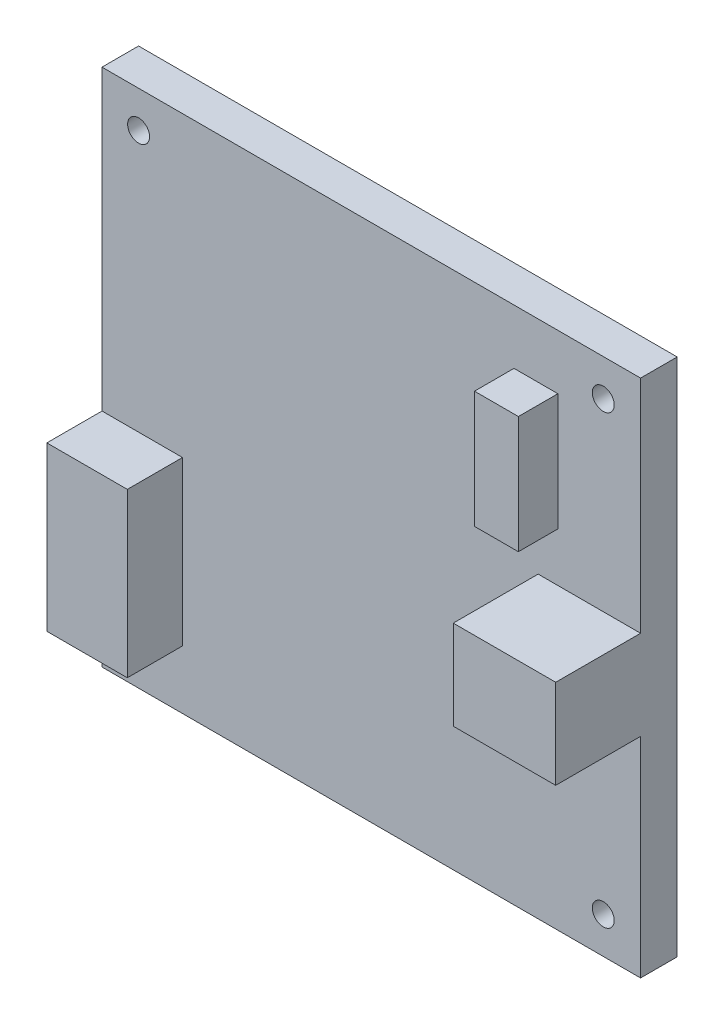
ISO-10303-21;
HEADER;
FILE_DESCRIPTION(('STEP AP214'),'2;1');
FILE_NAME('part.step','',(''),(''),'','','');
FILE_SCHEMA(('AUTOMOTIVE_DESIGN { 1 0 10303 214 1 1 1 1 }'));
ENDSEC;
DATA;
#1=APPLICATION_CONTEXT('core data for automotive mechanical design processes');
#2=APPLICATION_PROTOCOL_DEFINITION('international standard','automotive_design',2000,#1);
#3=PRODUCT_CONTEXT('',#1,'mechanical');
#4=PRODUCT('Part','Part','',(#3));
#5=PRODUCT_RELATED_PRODUCT_CATEGORY('part','',(#4));
#6=PRODUCT_DEFINITION_FORMATION('','',#4);
#7=PRODUCT_DEFINITION_CONTEXT('part definition',#1,'design');
#8=PRODUCT_DEFINITION('design','',#6,#7);
#9=PRODUCT_DEFINITION_SHAPE('','',#8);
#10=(LENGTH_UNIT() NAMED_UNIT(*) SI_UNIT(.MILLI.,.METRE.));
#11=(NAMED_UNIT(*) PLANE_ANGLE_UNIT() SI_UNIT($,.RADIAN.));
#12=(NAMED_UNIT(*) SI_UNIT($,.STERADIAN.) SOLID_ANGLE_UNIT());
#13=UNCERTAINTY_MEASURE_WITH_UNIT(LENGTH_MEASURE(1.E-05),#10,'distance_accuracy_value','');
#14=(GEOMETRIC_REPRESENTATION_CONTEXT(3) GLOBAL_UNCERTAINTY_ASSIGNED_CONTEXT((#13)) GLOBAL_UNIT_ASSIGNED_CONTEXT((#10,
#11,#12)) REPRESENTATION_CONTEXT('',''));
#15=CARTESIAN_POINT('',(0.,0.,0.));
#16=DIRECTION('',(0.,0.,1.));
#17=DIRECTION('',(1.,0.,0.));
#18=AXIS2_PLACEMENT_3D('',#15,#16,#17);
#19=CARTESIAN_POINT('',(0.,0.,5.));
#20=DIRECTION('',(0.,0.,-1.));
#21=DIRECTION('',(-1.,0.,0.));
#22=AXIS2_PLACEMENT_3D('',#19,#20,#21);
#23=PLANE('',#22);
#24=DIRECTION('',(-1.,0.,0.));
#25=VECTOR('',#24,1.);
#26=CARTESIAN_POINT('',(73.6,40.8,5.));
#27=LINE('',#26,#25);
#28=CARTESIAN_POINT('',(73.6,40.8,5.));
#29=VERTEX_POINT('',#28);
#30=CARTESIAN_POINT('',(59.6,40.8,5.));
#31=VERTEX_POINT('',#30);
#32=EDGE_CURVE('E168',#29,#31,#27,.T.);
#33=ORIENTED_EDGE('',*,*,#32,.F.);
#34=DIRECTION('',(0.,1.,0.));
#35=VECTOR('',#34,1.);
#36=CARTESIAN_POINT('',(73.6,0.,5.));
#37=LINE('',#36,#35);
#38=CARTESIAN_POINT('',(73.6,71.,5.));
#39=VERTEX_POINT('',#38);
#40=EDGE_CURVE('E263',#29,#39,#37,.T.);
#41=ORIENTED_EDGE('',*,*,#40,.T.);
#42=DIRECTION('',(-1.,0.,0.));
#43=VECTOR('',#42,1.);
#44=CARTESIAN_POINT('',(0.,71.,5.));
#45=LINE('',#44,#43);
#46=CARTESIAN_POINT('',(0.,71.,5.));
#47=VERTEX_POINT('',#46);
#48=EDGE_CURVE('E266',#39,#47,#45,.T.);
#49=ORIENTED_EDGE('',*,*,#48,.T.);
#50=DIRECTION('',(0.,-1.,0.));
#51=VECTOR('',#50,1.);
#52=CARTESIAN_POINT('',(0.,0.,5.));
#53=LINE('',#52,#51);
#54=CARTESIAN_POINT('',(0.,30.3,5.));
#55=VERTEX_POINT('',#54);
#56=EDGE_CURVE('E258',#47,#55,#53,.T.);
#57=ORIENTED_EDGE('',*,*,#56,.T.);
#58=DIRECTION('',(-1.,0.,0.));
#59=VECTOR('',#58,1.);
#60=CARTESIAN_POINT('',(0.,30.3,5.));
#61=LINE('',#60,#59);
#62=CARTESIAN_POINT('',(11.,30.3,5.));
#63=VERTEX_POINT('',#62);
#64=EDGE_CURVE('E208',#63,#55,#61,.T.);
#65=ORIENTED_EDGE('',*,*,#64,.F.);
#66=DIRECTION('',(0.,1.,0.));
#67=VECTOR('',#66,1.);
#68=CARTESIAN_POINT('',(11.,8.,5.));
#69=LINE('',#68,#67);
#70=CARTESIAN_POINT('',(11.,8.,5.));
#71=VERTEX_POINT('',#70);
#72=EDGE_CURVE('E217',#71,#63,#69,.T.);
#73=ORIENTED_EDGE('',*,*,#72,.F.);
#74=DIRECTION('',(1.,0.,0.));
#75=VECTOR('',#74,1.);
#76=CARTESIAN_POINT('',(0.,7.99999999999999,5.));
#77=LINE('',#76,#75);
#78=CARTESIAN_POINT('',(0.,8.,5.));
#79=VERTEX_POINT('',#78);
#80=EDGE_CURVE('E203',#79,#71,#77,.T.);
#81=ORIENTED_EDGE('',*,*,#80,.F.);
#82=CARTESIAN_POINT('',(0.,0.,5.));
#83=VERTEX_POINT('',#82);
#84=EDGE_CURVE('E261',#79,#83,#53,.T.);
#85=ORIENTED_EDGE('',*,*,#84,.T.);
#86=DIRECTION('',(1.,0.,0.));
#87=VECTOR('',#86,1.);
#88=CARTESIAN_POINT('',(0.,0.,5.));
#89=LINE('',#88,#87);
#90=CARTESIAN_POINT('',(73.6,0.,5.));
#91=VERTEX_POINT('',#90);
#92=EDGE_CURVE('E260',#83,#91,#89,.T.);
#93=ORIENTED_EDGE('',*,*,#92,.T.);
#94=CARTESIAN_POINT('',(73.6,28.6,5.));
#95=VERTEX_POINT('',#94);
#96=EDGE_CURVE('E264',#91,#95,#37,.T.);
#97=ORIENTED_EDGE('',*,*,#96,.T.);
#98=DIRECTION('',(1.,0.,0.));
#99=VECTOR('',#98,1.);
#100=CARTESIAN_POINT('',(73.6,28.6,5.));
#101=LINE('',#100,#99);
#102=CARTESIAN_POINT('',(59.6,28.6,5.));
#103=VERTEX_POINT('',#102);
#104=EDGE_CURVE('E181',#103,#95,#101,.T.);
#105=ORIENTED_EDGE('',*,*,#104,.F.);
#106=DIRECTION('',(0.,-1.,0.));
#107=VECTOR('',#106,1.);
#108=CARTESIAN_POINT('',(59.6,40.8,5.));
#109=LINE('',#108,#107);
#110=EDGE_CURVE('E171',#31,#103,#109,.T.);
#111=ORIENTED_EDGE('',*,*,#110,.F.);
#112=EDGE_LOOP('',(#33,#41,#49,#57,#65,#73,#81,#85,#93,#97,#105,#111));
#113=FACE_BOUND('',#112,.T.);
#114=CARTESIAN_POINT('',(5.,5.,5.));
#115=DIRECTION('',(0.,0.,1.));
#116=DIRECTION('',(1.,0.,0.));
#117=AXIS2_PLACEMENT_3D('',#114,#115,#116);
#118=CIRCLE('',#117,1.5);
#119=CARTESIAN_POINT('',(6.5,5.,5.));
#120=VERTEX_POINT('',#119);
#121=EDGE_CURVE('E237',#120,#120,#118,.T.);
#122=ORIENTED_EDGE('',*,*,#121,.F.);
#123=EDGE_LOOP('',(#122));
#124=FACE_BOUND('',#123,.T.);
#125=CARTESIAN_POINT('',(68.5,5.,5.));
#126=DIRECTION('',(0.,0.,1.));
#127=DIRECTION('',(1.,0.,0.));
#128=AXIS2_PLACEMENT_3D('',#125,#126,#127);
#129=CIRCLE('',#128,1.5);
#130=CARTESIAN_POINT('',(70.,5.,5.));
#131=VERTEX_POINT('',#130);
#132=EDGE_CURVE('E238',#131,#131,#129,.T.);
#133=ORIENTED_EDGE('',*,*,#132,.F.);
#134=EDGE_LOOP('',(#133));
#135=FACE_BOUND('',#134,.T.);
#136=CARTESIAN_POINT('',(68.5,66.,5.));
#137=DIRECTION('',(0.,0.,1.));
#138=DIRECTION('',(1.,0.,0.));
#139=AXIS2_PLACEMENT_3D('',#136,#137,#138);
#140=CIRCLE('',#139,1.5);
#141=CARTESIAN_POINT('',(70.,66.,5.));
#142=VERTEX_POINT('',#141);
#143=EDGE_CURVE('E244',#142,#142,#140,.T.);
#144=ORIENTED_EDGE('',*,*,#143,.F.);
#145=EDGE_LOOP('',(#144));
#146=FACE_BOUND('',#145,.T.);
#147=CARTESIAN_POINT('',(5.,66.,5.));
#148=DIRECTION('',(0.,0.,1.));
#149=DIRECTION('',(1.,0.,0.));
#150=AXIS2_PLACEMENT_3D('',#147,#148,#149);
#151=CIRCLE('',#150,1.5);
#152=CARTESIAN_POINT('',(6.5,66.,5.));
#153=VERTEX_POINT('',#152);
#154=EDGE_CURVE('E233',#153,#153,#151,.T.);
#155=ORIENTED_EDGE('',*,*,#154,.F.);
#156=EDGE_LOOP('',(#155));
#157=FACE_BOUND('',#156,.T.);
#158=DIRECTION('',(0.,-1.,0.));
#159=VECTOR('',#158,1.);
#160=CARTESIAN_POINT('',(56.3,63.5,5.));
#161=LINE('',#160,#159);
#162=CARTESIAN_POINT('',(56.3,63.5,5.));
#163=VERTEX_POINT('',#162);
#164=CARTESIAN_POINT('',(56.3,47.5,5.));
#165=VERTEX_POINT('',#164);
#166=EDGE_CURVE('E167',#163,#165,#161,.T.);
#167=ORIENTED_EDGE('',*,*,#166,.F.);
#168=DIRECTION('',(-1.,0.,0.));
#169=VECTOR('',#168,1.);
#170=CARTESIAN_POINT('',(56.3,63.5,5.));
#171=LINE('',#170,#169);
#172=CARTESIAN_POINT('',(62.3,63.5,5.));
#173=VERTEX_POINT('',#172);
#174=EDGE_CURVE('E164',#173,#163,#171,.T.);
#175=ORIENTED_EDGE('',*,*,#174,.F.);
#176=DIRECTION('',(0.,1.,0.));
#177=VECTOR('',#176,1.);
#178=CARTESIAN_POINT('',(62.3,63.5,5.));
#179=LINE('',#178,#177);
#180=CARTESIAN_POINT('',(62.3,47.5,5.));
#181=VERTEX_POINT('',#180);
#182=EDGE_CURVE('E54',#181,#173,#179,.T.);
#183=ORIENTED_EDGE('',*,*,#182,.F.);
#184=DIRECTION('',(1.,0.,0.));
#185=VECTOR('',#184,1.);
#186=CARTESIAN_POINT('',(56.3,47.5,5.));
#187=LINE('',#186,#185);
#188=EDGE_CURVE('E49',#165,#181,#187,.T.);
#189=ORIENTED_EDGE('',*,*,#188,.F.);
#190=EDGE_LOOP('',(#167,#175,#183,#189));
#191=FACE_BOUND('',#190,.T.);
#192=ADVANCED_FACE('F34',(#113,#124,#135,#146,#157,#191),#23,.F.);
#193=CARTESIAN_POINT('',(0.,0.,5.));
#194=DIRECTION('',(1.,0.,0.));
#195=DIRECTION('',(0.,0.,-1.));
#196=AXIS2_PLACEMENT_3D('',#193,#194,#195);
#197=PLANE('',#196);
#198=DIRECTION('',(0.,-1.,0.));
#199=VECTOR('',#198,1.);
#200=CARTESIAN_POINT('',(0.,0.,0.));
#201=LINE('',#200,#199);
#202=CARTESIAN_POINT('',(0.,71.,0.));
#203=VERTEX_POINT('',#202);
#204=CARTESIAN_POINT('',(0.,0.,0.));
#205=VERTEX_POINT('',#204);
#206=EDGE_CURVE('E255',#203,#205,#201,.T.);
#207=ORIENTED_EDGE('',*,*,#206,.T.);
#208=DIRECTION('',(0.,0.,-1.));
#209=VECTOR('',#208,1.);
#210=CARTESIAN_POINT('',(0.,0.,5.));
#211=LINE('',#210,#209);
#212=EDGE_CURVE('E11',#83,#205,#211,.T.);
#213=ORIENTED_EDGE('',*,*,#212,.F.);
#214=ORIENTED_EDGE('',*,*,#84,.F.);
#215=DIRECTION('',(0.,0.,-1.));
#216=VECTOR('',#215,1.);
#217=CARTESIAN_POINT('',(0.,7.99999999999999,12.54));
#218=LINE('',#217,#216);
#219=CARTESIAN_POINT('',(0.,7.99999999999999,12.54));
#220=VERTEX_POINT('',#219);
#221=EDGE_CURVE('E230',#220,#79,#218,.T.);
#222=ORIENTED_EDGE('',*,*,#221,.F.);
#223=DIRECTION('',(0.,-1.,0.));
#224=VECTOR('',#223,1.);
#225=CARTESIAN_POINT('',(0.,7.99999999999999,12.54));
#226=LINE('',#225,#224);
#227=CARTESIAN_POINT('',(0.,30.3,12.54));
#228=VERTEX_POINT('',#227);
#229=EDGE_CURVE('E204',#228,#220,#226,.T.);
#230=ORIENTED_EDGE('',*,*,#229,.F.);
#231=DIRECTION('',(0.,0.,-1.));
#232=VECTOR('',#231,1.);
#233=CARTESIAN_POINT('',(0.,30.3,12.54));
#234=LINE('',#233,#232);
#235=EDGE_CURVE('E214',#228,#55,#234,.T.);
#236=ORIENTED_EDGE('',*,*,#235,.T.);
#237=ORIENTED_EDGE('',*,*,#56,.F.);
#238=DIRECTION('',(0.,0.,-1.));
#239=VECTOR('',#238,1.);
#240=CARTESIAN_POINT('',(0.,71.,5.));
#241=LINE('',#240,#239);
#242=EDGE_CURVE('E268',#47,#203,#241,.T.);
#243=ORIENTED_EDGE('',*,*,#242,.T.);
#244=EDGE_LOOP('',(#207,#213,#214,#222,#230,#236,#237,#243));
#245=FACE_BOUND('',#244,.T.);
#246=ADVANCED_FACE('F36',(#245),#197,.F.);
#247=CARTESIAN_POINT('',(0.,0.,5.));
#248=DIRECTION('',(0.,1.,0.));
#249=DIRECTION('',(0.,0.,1.));
#250=AXIS2_PLACEMENT_3D('',#247,#248,#249);
#251=PLANE('',#250);
#252=DIRECTION('',(1.,0.,0.));
#253=VECTOR('',#252,1.);
#254=CARTESIAN_POINT('',(0.,0.,0.));
#255=LINE('',#254,#253);
#256=CARTESIAN_POINT('',(73.6,0.,0.));
#257=VERTEX_POINT('',#256);
#258=EDGE_CURVE('E271',#205,#257,#255,.T.);
#259=ORIENTED_EDGE('',*,*,#258,.T.);
#260=DIRECTION('',(0.,0.,-1.));
#261=VECTOR('',#260,1.);
#262=CARTESIAN_POINT('',(73.6,0.,5.));
#263=LINE('',#262,#261);
#264=EDGE_CURVE('E42',#91,#257,#263,.T.);
#265=ORIENTED_EDGE('',*,*,#264,.F.);
#266=ORIENTED_EDGE('',*,*,#92,.F.);
#267=ORIENTED_EDGE('',*,*,#212,.T.);
#268=EDGE_LOOP('',(#259,#265,#266,#267));
#269=FACE_BOUND('',#268,.T.);
#270=ADVANCED_FACE('F318',(#269),#251,.F.);
#271=CARTESIAN_POINT('',(73.6,0.,5.));
#272=DIRECTION('',(-1.,0.,0.));
#273=DIRECTION('',(0.,0.,1.));
#274=AXIS2_PLACEMENT_3D('',#271,#272,#273);
#275=PLANE('',#274);
#276=DIRECTION('',(0.,1.,0.));
#277=VECTOR('',#276,1.);
#278=CARTESIAN_POINT('',(73.6,0.,0.));
#279=LINE('',#278,#277);
#280=CARTESIAN_POINT('',(73.6,71.,0.));
#281=VERTEX_POINT('',#280);
#282=EDGE_CURVE('E273',#257,#281,#279,.T.);
#283=ORIENTED_EDGE('',*,*,#282,.T.);
#284=DIRECTION('',(0.,0.,-1.));
#285=VECTOR('',#284,1.);
#286=CARTESIAN_POINT('',(73.6,71.,5.));
#287=LINE('',#286,#285);
#288=EDGE_CURVE('E279',#39,#281,#287,.T.);
#289=ORIENTED_EDGE('',*,*,#288,.F.);
#290=ORIENTED_EDGE('',*,*,#40,.F.);
#291=DIRECTION('',(0.,0.,-1.));
#292=VECTOR('',#291,1.);
#293=CARTESIAN_POINT('',(73.6,40.8,16.6));
#294=LINE('',#293,#292);
#295=CARTESIAN_POINT('',(73.6,40.8,16.6));
#296=VERTEX_POINT('',#295);
#297=EDGE_CURVE('E200',#296,#29,#294,.T.);
#298=ORIENTED_EDGE('',*,*,#297,.F.);
#299=DIRECTION('',(0.,1.,0.));
#300=VECTOR('',#299,1.);
#301=CARTESIAN_POINT('',(73.6,40.8,16.6));
#302=LINE('',#301,#300);
#303=CARTESIAN_POINT('',(73.6,28.6,16.6));
#304=VERTEX_POINT('',#303);
#305=EDGE_CURVE('E177',#304,#296,#302,.T.);
#306=ORIENTED_EDGE('',*,*,#305,.F.);
#307=DIRECTION('',(0.,0.,-1.));
#308=VECTOR('',#307,1.);
#309=CARTESIAN_POINT('',(73.6,28.6,16.6));
#310=LINE('',#309,#308);
#311=EDGE_CURVE('E186',#304,#95,#310,.T.);
#312=ORIENTED_EDGE('',*,*,#311,.T.);
#313=ORIENTED_EDGE('',*,*,#96,.F.);
#314=ORIENTED_EDGE('',*,*,#264,.T.);
#315=EDGE_LOOP('',(#283,#289,#290,#298,#306,#312,#313,#314));
#316=FACE_BOUND('',#315,.T.);
#317=ADVANCED_FACE('F286',(#316),#275,.F.);
#318=CARTESIAN_POINT('',(0.,71.,5.));
#319=DIRECTION('',(0.,-1.,0.));
#320=DIRECTION('',(0.,0.,-1.));
#321=AXIS2_PLACEMENT_3D('',#318,#319,#320);
#322=PLANE('',#321);
#323=DIRECTION('',(-1.,0.,0.));
#324=VECTOR('',#323,1.);
#325=CARTESIAN_POINT('',(0.,71.,0.));
#326=LINE('',#325,#324);
#327=EDGE_CURVE('E275',#281,#203,#326,.T.);
#328=ORIENTED_EDGE('',*,*,#327,.T.);
#329=ORIENTED_EDGE('',*,*,#242,.F.);
#330=ORIENTED_EDGE('',*,*,#48,.F.);
#331=ORIENTED_EDGE('',*,*,#288,.T.);
#332=EDGE_LOOP('',(#328,#329,#330,#331));
#333=FACE_BOUND('',#332,.T.);
#334=ADVANCED_FACE('F296',(#333),#322,.F.);
#335=CARTESIAN_POINT('',(0.,0.,0.));
#336=DIRECTION('',(0.,0.,-1.));
#337=DIRECTION('',(-1.,0.,0.));
#338=AXIS2_PLACEMENT_3D('',#335,#336,#337);
#339=PLANE('',#338);
#340=CARTESIAN_POINT('',(5.,66.,0.));
#341=DIRECTION('',(0.,0.,1.));
#342=DIRECTION('',(1.,0.,0.));
#343=AXIS2_PLACEMENT_3D('',#340,#341,#342);
#344=CIRCLE('',#343,1.5);
#345=CARTESIAN_POINT('',(6.5,66.,0.));
#346=VERTEX_POINT('',#345);
#347=EDGE_CURVE('E247',#346,#346,#344,.T.);
#348=ORIENTED_EDGE('',*,*,#347,.T.);
#349=EDGE_LOOP('',(#348));
#350=FACE_BOUND('',#349,.T.);
#351=CARTESIAN_POINT('',(68.5,66.,0.));
#352=DIRECTION('',(0.,0.,1.));
#353=DIRECTION('',(1.,0.,0.));
#354=AXIS2_PLACEMENT_3D('',#351,#352,#353);
#355=CIRCLE('',#354,1.5);
#356=CARTESIAN_POINT('',(70.,66.,0.));
#357=VERTEX_POINT('',#356);
#358=EDGE_CURVE('E241',#357,#357,#355,.T.);
#359=ORIENTED_EDGE('',*,*,#358,.T.);
#360=EDGE_LOOP('',(#359));
#361=FACE_BOUND('',#360,.T.);
#362=CARTESIAN_POINT('',(68.5,5.,0.));
#363=DIRECTION('',(0.,0.,1.));
#364=DIRECTION('',(1.,0.,0.));
#365=AXIS2_PLACEMENT_3D('',#362,#363,#364);
#366=CIRCLE('',#365,1.5);
#367=CARTESIAN_POINT('',(70.,5.,0.));
#368=VERTEX_POINT('',#367);
#369=EDGE_CURVE('E234',#368,#368,#366,.T.);
#370=ORIENTED_EDGE('',*,*,#369,.T.);
#371=EDGE_LOOP('',(#370));
#372=FACE_BOUND('',#371,.T.);
#373=CARTESIAN_POINT('',(5.,5.,0.));
#374=DIRECTION('',(0.,0.,1.));
#375=DIRECTION('',(1.,0.,0.));
#376=AXIS2_PLACEMENT_3D('',#373,#374,#375);
#377=CIRCLE('',#376,1.5);
#378=CARTESIAN_POINT('',(6.5,5.,0.));
#379=VERTEX_POINT('',#378);
#380=EDGE_CURVE('E252',#379,#379,#377,.T.);
#381=ORIENTED_EDGE('',*,*,#380,.T.);
#382=EDGE_LOOP('',(#381));
#383=FACE_BOUND('',#382,.T.);
#384=ORIENTED_EDGE('',*,*,#206,.F.);
#385=ORIENTED_EDGE('',*,*,#327,.F.);
#386=ORIENTED_EDGE('',*,*,#282,.F.);
#387=ORIENTED_EDGE('',*,*,#258,.F.);
#388=EDGE_LOOP('',(#384,#385,#386,#387));
#389=FACE_BOUND('',#388,.T.);
#390=ADVANCED_FACE('F293',(#350,#361,#372,#383,#389),#339,.T.);
#391=CARTESIAN_POINT('',(5.,5.,0.));
#392=DIRECTION('',(0.,0.,1.));
#393=DIRECTION('',(1.,0.,0.));
#394=AXIS2_PLACEMENT_3D('',#391,#392,#393);
#395=CYLINDRICAL_SURFACE('',#394,1.5);
#396=ORIENTED_EDGE('',*,*,#380,.F.);
#397=EDGE_LOOP('',(#396));
#398=FACE_BOUND('',#397,.T.);
#399=ORIENTED_EDGE('',*,*,#121,.T.);
#400=EDGE_LOOP('',(#399));
#401=FACE_BOUND('',#400,.T.);
#402=ADVANCED_FACE('F331',(#398,#401),#395,.F.);
#403=CARTESIAN_POINT('',(68.5,5.,0.));
#404=DIRECTION('',(0.,0.,1.));
#405=DIRECTION('',(1.,0.,0.));
#406=AXIS2_PLACEMENT_3D('',#403,#404,#405);
#407=CYLINDRICAL_SURFACE('',#406,1.5);
#408=ORIENTED_EDGE('',*,*,#369,.F.);
#409=EDGE_LOOP('',(#408));
#410=FACE_BOUND('',#409,.T.);
#411=ORIENTED_EDGE('',*,*,#132,.T.);
#412=EDGE_LOOP('',(#411));
#413=FACE_BOUND('',#412,.T.);
#414=ADVANCED_FACE('F351',(#410,#413),#407,.F.);
#415=CARTESIAN_POINT('',(68.5,66.,0.));
#416=DIRECTION('',(0.,0.,1.));
#417=DIRECTION('',(1.,0.,0.));
#418=AXIS2_PLACEMENT_3D('',#415,#416,#417);
#419=CYLINDRICAL_SURFACE('',#418,1.5);
#420=ORIENTED_EDGE('',*,*,#358,.F.);
#421=EDGE_LOOP('',(#420));
#422=FACE_BOUND('',#421,.T.);
#423=ORIENTED_EDGE('',*,*,#143,.T.);
#424=EDGE_LOOP('',(#423));
#425=FACE_BOUND('',#424,.T.);
#426=ADVANCED_FACE('F358',(#422,#425),#419,.F.);
#427=CARTESIAN_POINT('',(5.,66.,0.));
#428=DIRECTION('',(0.,0.,1.));
#429=DIRECTION('',(1.,0.,0.));
#430=AXIS2_PLACEMENT_3D('',#427,#428,#429);
#431=CYLINDRICAL_SURFACE('',#430,1.5);
#432=ORIENTED_EDGE('',*,*,#347,.F.);
#433=EDGE_LOOP('',(#432));
#434=FACE_BOUND('',#433,.T.);
#435=ORIENTED_EDGE('',*,*,#154,.T.);
#436=EDGE_LOOP('',(#435));
#437=FACE_BOUND('',#436,.T.);
#438=ADVANCED_FACE('F366',(#434,#437),#431,.F.);
#439=CARTESIAN_POINT('',(0.,7.99999999999999,12.54));
#440=DIRECTION('',(0.,1.,0.));
#441=DIRECTION('',(-1.,0.,0.));
#442=AXIS2_PLACEMENT_3D('',#439,#440,#441);
#443=PLANE('',#442);
#444=ORIENTED_EDGE('',*,*,#80,.T.);
#445=DIRECTION('',(0.,0.,-1.));
#446=VECTOR('',#445,1.);
#447=CARTESIAN_POINT('',(11.,8.,12.54));
#448=LINE('',#447,#446);
#449=CARTESIAN_POINT('',(11.,8.,12.54));
#450=VERTEX_POINT('',#449);
#451=EDGE_CURVE('E227',#450,#71,#448,.T.);
#452=ORIENTED_EDGE('',*,*,#451,.F.);
#453=DIRECTION('',(1.,0.,0.));
#454=VECTOR('',#453,1.);
#455=CARTESIAN_POINT('',(0.,7.99999999999999,12.54));
#456=LINE('',#455,#454);
#457=EDGE_CURVE('E207',#220,#450,#456,.T.);
#458=ORIENTED_EDGE('',*,*,#457,.F.);
#459=ORIENTED_EDGE('',*,*,#221,.T.);
#460=EDGE_LOOP('',(#444,#452,#458,#459));
#461=FACE_BOUND('',#460,.T.);
#462=ADVANCED_FACE('F316',(#461),#443,.F.);
#463=CARTESIAN_POINT('',(11.,8.,12.54));
#464=DIRECTION('',(-1.,0.,0.));
#465=DIRECTION('',(0.,0.,1.));
#466=AXIS2_PLACEMENT_3D('',#463,#464,#465);
#467=PLANE('',#466);
#468=ORIENTED_EDGE('',*,*,#72,.T.);
#469=DIRECTION('',(0.,0.,-1.));
#470=VECTOR('',#469,1.);
#471=CARTESIAN_POINT('',(11.,30.3,12.54));
#472=LINE('',#471,#470);
#473=CARTESIAN_POINT('',(11.,30.3,12.54));
#474=VERTEX_POINT('',#473);
#475=EDGE_CURVE('E224',#474,#63,#472,.T.);
#476=ORIENTED_EDGE('',*,*,#475,.F.);
#477=DIRECTION('',(0.,1.,0.));
#478=VECTOR('',#477,1.);
#479=CARTESIAN_POINT('',(11.,8.,12.54));
#480=LINE('',#479,#478);
#481=EDGE_CURVE('E210',#450,#474,#480,.T.);
#482=ORIENTED_EDGE('',*,*,#481,.F.);
#483=ORIENTED_EDGE('',*,*,#451,.T.);
#484=EDGE_LOOP('',(#468,#476,#482,#483));
#485=FACE_BOUND('',#484,.T.);
#486=ADVANCED_FACE('F312',(#485),#467,.F.);
#487=CARTESIAN_POINT('',(0.,30.3,12.54));
#488=DIRECTION('',(0.,-1.,0.));
#489=DIRECTION('',(0.,0.,-1.));
#490=AXIS2_PLACEMENT_3D('',#487,#488,#489);
#491=PLANE('',#490);
#492=ORIENTED_EDGE('',*,*,#64,.T.);
#493=ORIENTED_EDGE('',*,*,#235,.F.);
#494=DIRECTION('',(-1.,0.,0.));
#495=VECTOR('',#494,1.);
#496=CARTESIAN_POINT('',(0.,30.3,12.54));
#497=LINE('',#496,#495);
#498=EDGE_CURVE('E212',#474,#228,#497,.T.);
#499=ORIENTED_EDGE('',*,*,#498,.F.);
#500=ORIENTED_EDGE('',*,*,#475,.T.);
#501=EDGE_LOOP('',(#492,#493,#499,#500));
#502=FACE_BOUND('',#501,.T.);
#503=ADVANCED_FACE('F307',(#502),#491,.F.);
#504=CARTESIAN_POINT('',(0.,0.,12.54));
#505=DIRECTION('',(0.,0.,-1.));
#506=DIRECTION('',(-1.,0.,0.));
#507=AXIS2_PLACEMENT_3D('',#504,#505,#506);
#508=PLANE('',#507);
#509=ORIENTED_EDGE('',*,*,#229,.T.);
#510=ORIENTED_EDGE('',*,*,#457,.T.);
#511=ORIENTED_EDGE('',*,*,#481,.T.);
#512=ORIENTED_EDGE('',*,*,#498,.T.);
#513=EDGE_LOOP('',(#509,#510,#511,#512));
#514=FACE_BOUND('',#513,.T.);
#515=ADVANCED_FACE('F393',(#514),#508,.F.);
#516=CARTESIAN_POINT('',(73.6,40.8,16.6));
#517=DIRECTION('',(0.,-1.,0.));
#518=DIRECTION('',(0.,0.,-1.));
#519=AXIS2_PLACEMENT_3D('',#516,#517,#518);
#520=PLANE('',#519);
#521=ORIENTED_EDGE('',*,*,#32,.T.);
#522=DIRECTION('',(0.,0.,-1.));
#523=VECTOR('',#522,1.);
#524=CARTESIAN_POINT('',(59.6,40.8,16.6));
#525=LINE('',#524,#523);
#526=CARTESIAN_POINT('',(59.6,40.8,16.6));
#527=VERTEX_POINT('',#526);
#528=EDGE_CURVE('E197',#527,#31,#525,.T.);
#529=ORIENTED_EDGE('',*,*,#528,.F.);
#530=DIRECTION('',(-1.,0.,0.));
#531=VECTOR('',#530,1.);
#532=CARTESIAN_POINT('',(73.6,40.8,16.6));
#533=LINE('',#532,#531);
#534=EDGE_CURVE('E180',#296,#527,#533,.T.);
#535=ORIENTED_EDGE('',*,*,#534,.F.);
#536=ORIENTED_EDGE('',*,*,#297,.T.);
#537=EDGE_LOOP('',(#521,#529,#535,#536));
#538=FACE_BOUND('',#537,.T.);
#539=ADVANCED_FACE('F400',(#538),#520,.F.);
#540=CARTESIAN_POINT('',(59.6,40.8,16.6));
#541=DIRECTION('',(1.,0.,0.));
#542=DIRECTION('',(0.,1.,0.));
#543=AXIS2_PLACEMENT_3D('',#540,#541,#542);
#544=PLANE('',#543);
#545=ORIENTED_EDGE('',*,*,#110,.T.);
#546=DIRECTION('',(0.,0.,-1.));
#547=VECTOR('',#546,1.);
#548=CARTESIAN_POINT('',(59.6,28.6,16.6));
#549=LINE('',#548,#547);
#550=CARTESIAN_POINT('',(59.6,28.6,16.6));
#551=VERTEX_POINT('',#550);
#552=EDGE_CURVE('E194',#551,#103,#549,.T.);
#553=ORIENTED_EDGE('',*,*,#552,.F.);
#554=DIRECTION('',(0.,-1.,0.));
#555=VECTOR('',#554,1.);
#556=CARTESIAN_POINT('',(59.6,40.8,16.6));
#557=LINE('',#556,#555);
#558=EDGE_CURVE('E183',#527,#551,#557,.T.);
#559=ORIENTED_EDGE('',*,*,#558,.F.);
#560=ORIENTED_EDGE('',*,*,#528,.T.);
#561=EDGE_LOOP('',(#545,#553,#559,#560));
#562=FACE_BOUND('',#561,.T.);
#563=ADVANCED_FACE('F408',(#562),#544,.F.);
#564=CARTESIAN_POINT('',(73.6,28.6,16.6));
#565=DIRECTION('',(0.,1.,0.));
#566=DIRECTION('',(0.,0.,1.));
#567=AXIS2_PLACEMENT_3D('',#564,#565,#566);
#568=PLANE('',#567);
#569=ORIENTED_EDGE('',*,*,#104,.T.);
#570=ORIENTED_EDGE('',*,*,#311,.F.);
#571=DIRECTION('',(1.,0.,0.));
#572=VECTOR('',#571,1.);
#573=CARTESIAN_POINT('',(73.6,28.6,16.6));
#574=LINE('',#573,#572);
#575=EDGE_CURVE('E185',#551,#304,#574,.T.);
#576=ORIENTED_EDGE('',*,*,#575,.F.);
#577=ORIENTED_EDGE('',*,*,#552,.T.);
#578=EDGE_LOOP('',(#569,#570,#576,#577));
#579=FACE_BOUND('',#578,.T.);
#580=ADVANCED_FACE('F416',(#579),#568,.F.);
#581=CARTESIAN_POINT('',(0.,0.,16.6));
#582=DIRECTION('',(0.,0.,-1.));
#583=DIRECTION('',(-1.,0.,0.));
#584=AXIS2_PLACEMENT_3D('',#581,#582,#583);
#585=PLANE('',#584);
#586=ORIENTED_EDGE('',*,*,#305,.T.);
#587=ORIENTED_EDGE('',*,*,#534,.T.);
#588=ORIENTED_EDGE('',*,*,#558,.T.);
#589=ORIENTED_EDGE('',*,*,#575,.T.);
#590=EDGE_LOOP('',(#586,#587,#588,#589));
#591=FACE_BOUND('',#590,.T.);
#592=ADVANCED_FACE('F424',(#591),#585,.F.);
#593=CARTESIAN_POINT('',(56.3,63.5,10.4));
#594=DIRECTION('',(1.,0.,0.));
#595=DIRECTION('',(0.,0.,-1.));
#596=AXIS2_PLACEMENT_3D('',#593,#594,#595);
#597=PLANE('',#596);
#598=ORIENTED_EDGE('',*,*,#166,.T.);
#599=DIRECTION('',(0.,0.,-1.));
#600=VECTOR('',#599,1.);
#601=CARTESIAN_POINT('',(56.3,47.5,10.4));
#602=LINE('',#601,#600);
#603=CARTESIAN_POINT('',(56.3,47.5,10.4));
#604=VERTEX_POINT('',#603);
#605=EDGE_CURVE('E148',#604,#165,#602,.T.);
#606=ORIENTED_EDGE('',*,*,#605,.F.);
#607=DIRECTION('',(0.,-1.,0.));
#608=VECTOR('',#607,1.);
#609=CARTESIAN_POINT('',(56.3,63.5,10.4));
#610=LINE('',#609,#608);
#611=CARTESIAN_POINT('',(56.3,63.5,10.4));
#612=VERTEX_POINT('',#611);
#613=EDGE_CURVE('E155',#612,#604,#610,.T.);
#614=ORIENTED_EDGE('',*,*,#613,.F.);
#615=DIRECTION('',(0.,0.,-1.));
#616=VECTOR('',#615,1.);
#617=CARTESIAN_POINT('',(56.3,63.5,10.4));
#618=LINE('',#617,#616);
#619=EDGE_CURVE('E532',#612,#163,#618,.T.);
#620=ORIENTED_EDGE('',*,*,#619,.T.);
#621=EDGE_LOOP('',(#598,#606,#614,#620));
#622=FACE_BOUND('',#621,.T.);
#623=ADVANCED_FACE('F166',(#622),#597,.F.);
#624=CARTESIAN_POINT('',(56.3,47.5,10.4));
#625=DIRECTION('',(0.,1.,0.));
#626=DIRECTION('',(0.,0.,1.));
#627=AXIS2_PLACEMENT_3D('',#624,#625,#626);
#628=PLANE('',#627);
#629=ORIENTED_EDGE('',*,*,#188,.T.);
#630=DIRECTION('',(0.,0.,-1.));
#631=VECTOR('',#630,1.);
#632=CARTESIAN_POINT('',(62.3,47.5,10.4));
#633=LINE('',#632,#631);
#634=CARTESIAN_POINT('',(62.3,47.5,10.4));
#635=VERTEX_POINT('',#634);
#636=EDGE_CURVE('E151',#635,#181,#633,.T.);
#637=ORIENTED_EDGE('',*,*,#636,.F.);
#638=DIRECTION('',(1.,0.,0.));
#639=VECTOR('',#638,1.);
#640=CARTESIAN_POINT('',(56.3,47.5,10.4));
#641=LINE('',#640,#639);
#642=EDGE_CURVE('E144',#604,#635,#641,.T.);
#643=ORIENTED_EDGE('',*,*,#642,.F.);
#644=ORIENTED_EDGE('',*,*,#605,.T.);
#645=EDGE_LOOP('',(#629,#637,#643,#644));
#646=FACE_BOUND('',#645,.T.);
#647=ADVANCED_FACE('F146',(#646),#628,.F.);
#648=CARTESIAN_POINT('',(62.3,63.5,10.4));
#649=DIRECTION('',(-1.,0.,0.));
#650=DIRECTION('',(0.,0.,1.));
#651=AXIS2_PLACEMENT_3D('',#648,#649,#650);
#652=PLANE('',#651);
#653=ORIENTED_EDGE('',*,*,#182,.T.);
#654=DIRECTION('',(0.,0.,-1.));
#655=VECTOR('',#654,1.);
#656=CARTESIAN_POINT('',(62.3,63.5,10.4));
#657=LINE('',#656,#655);
#658=CARTESIAN_POINT('',(62.3,63.5,10.4));
#659=VERTEX_POINT('',#658);
#660=EDGE_CURVE('E173',#659,#173,#657,.T.);
#661=ORIENTED_EDGE('',*,*,#660,.F.);
#662=DIRECTION('',(0.,1.,0.));
#663=VECTOR('',#662,1.);
#664=CARTESIAN_POINT('',(62.3,63.5,10.4));
#665=LINE('',#664,#663);
#666=EDGE_CURVE('E154',#635,#659,#665,.T.);
#667=ORIENTED_EDGE('',*,*,#666,.F.);
#668=ORIENTED_EDGE('',*,*,#636,.T.);
#669=EDGE_LOOP('',(#653,#661,#667,#668));
#670=FACE_BOUND('',#669,.T.);
#671=ADVANCED_FACE('F445',(#670),#652,.F.);
#672=CARTESIAN_POINT('',(56.3,63.5,10.4));
#673=DIRECTION('',(0.,-1.,0.));
#674=DIRECTION('',(0.,0.,-1.));
#675=AXIS2_PLACEMENT_3D('',#672,#673,#674);
#676=PLANE('',#675);
#677=ORIENTED_EDGE('',*,*,#174,.T.);
#678=ORIENTED_EDGE('',*,*,#619,.F.);
#679=DIRECTION('',(-1.,0.,0.));
#680=VECTOR('',#679,1.);
#681=CARTESIAN_POINT('',(56.3,63.5,10.4));
#682=LINE('',#681,#680);
#683=EDGE_CURVE('E160',#659,#612,#682,.T.);
#684=ORIENTED_EDGE('',*,*,#683,.F.);
#685=ORIENTED_EDGE('',*,*,#660,.T.);
#686=EDGE_LOOP('',(#677,#678,#684,#685));
#687=FACE_BOUND('',#686,.T.);
#688=ADVANCED_FACE('F452',(#687),#676,.F.);
#689=CARTESIAN_POINT('',(0.,0.,10.4));
#690=DIRECTION('',(0.,0.,1.));
#691=DIRECTION('',(1.,0.,0.));
#692=AXIS2_PLACEMENT_3D('',#689,#690,#691);
#693=PLANE('',#692);
#694=ORIENTED_EDGE('',*,*,#613,.T.);
#695=ORIENTED_EDGE('',*,*,#642,.T.);
#696=ORIENTED_EDGE('',*,*,#666,.T.);
#697=ORIENTED_EDGE('',*,*,#683,.T.);
#698=EDGE_LOOP('',(#694,#695,#696,#697));
#699=FACE_BOUND('',#698,.T.);
#700=ADVANCED_FACE('F158',(#699),#693,.T.);
#701=CLOSED_SHELL('',(#192,#246,#270,#317,#334,#390,#402,#414,#426,#438,#462,#486,#503,#515,
#539,#563,#580,#592,#623,#647,#671,#688,#700));
#702=MANIFOLD_SOLID_BREP('B2',#701);
#703=ADVANCED_BREP_SHAPE_REPRESENTATION('',(#18,#702),#14);
#704=SHAPE_DEFINITION_REPRESENTATION(#9,#703);
ENDSEC;
END-ISO-10303-21;
